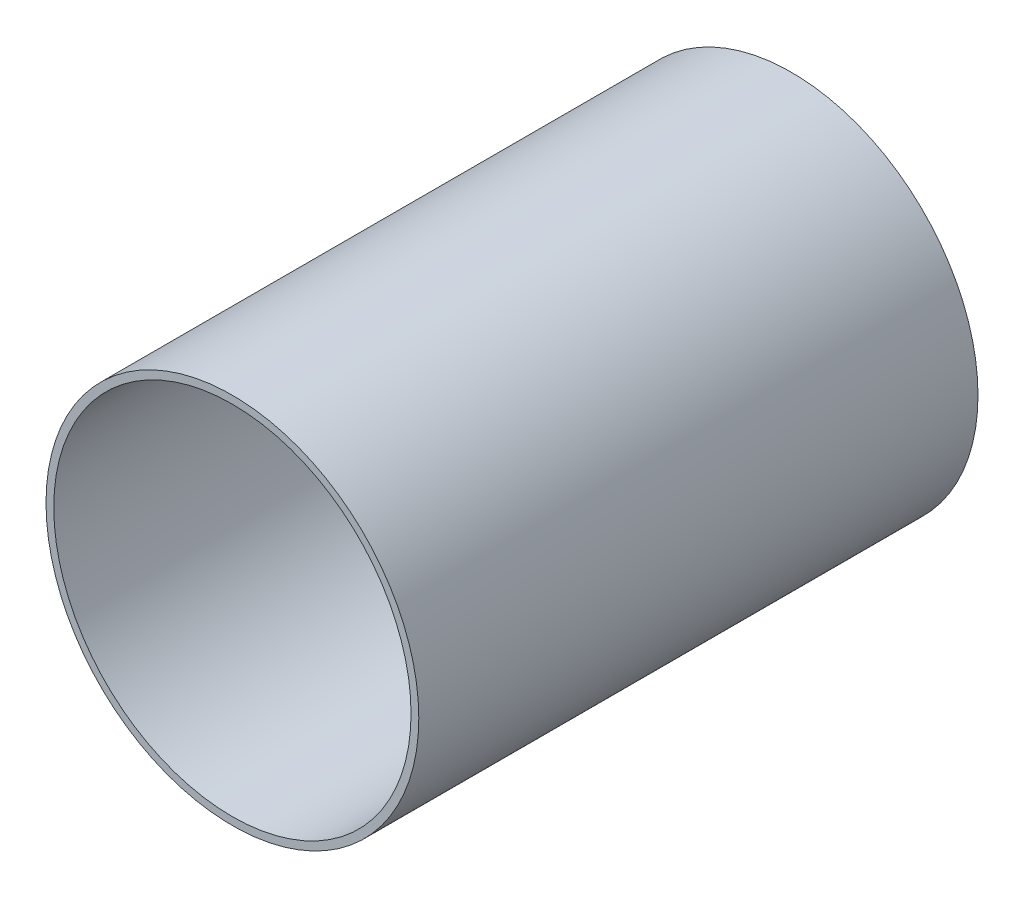
ISO-10303-21;
HEADER;
FILE_DESCRIPTION(('STEP AP214'),'2;1');
FILE_NAME('part.step','',(''),(''),'','','');
FILE_SCHEMA(('AUTOMOTIVE_DESIGN { 1 0 10303 214 1 1 1 1 }'));
ENDSEC;
DATA;
#1=APPLICATION_CONTEXT('core data for automotive mechanical design processes');
#2=APPLICATION_PROTOCOL_DEFINITION('international standard','automotive_design',2000,#1);
#3=PRODUCT_CONTEXT('',#1,'mechanical');
#4=PRODUCT('Part','Part','',(#3));
#5=PRODUCT_RELATED_PRODUCT_CATEGORY('part','',(#4));
#6=PRODUCT_DEFINITION_FORMATION('','',#4);
#7=PRODUCT_DEFINITION_CONTEXT('part definition',#1,'design');
#8=PRODUCT_DEFINITION('design','',#6,#7);
#9=PRODUCT_DEFINITION_SHAPE('','',#8);
#10=(LENGTH_UNIT() NAMED_UNIT(*) SI_UNIT(.MILLI.,.METRE.));
#11=(NAMED_UNIT(*) PLANE_ANGLE_UNIT() SI_UNIT($,.RADIAN.));
#12=(NAMED_UNIT(*) SI_UNIT($,.STERADIAN.) SOLID_ANGLE_UNIT());
#13=UNCERTAINTY_MEASURE_WITH_UNIT(LENGTH_MEASURE(1.E-05),#10,'distance_accuracy_value','');
#14=(GEOMETRIC_REPRESENTATION_CONTEXT(3) GLOBAL_UNCERTAINTY_ASSIGNED_CONTEXT((#13)) GLOBAL_UNIT_ASSIGNED_CONTEXT((#10,
#11,#12)) REPRESENTATION_CONTEXT('',''));
#15=CARTESIAN_POINT('',(0.,0.,0.));
#16=DIRECTION('',(0.,0.,1.));
#17=DIRECTION('',(1.,0.,0.));
#18=AXIS2_PLACEMENT_3D('',#15,#16,#17);
#19=CARTESIAN_POINT('',(0.,0.,228.6));
#20=DIRECTION('',(0.,0.,1.));
#21=DIRECTION('',(1.,0.,0.));
#22=AXIS2_PLACEMENT_3D('',#19,#20,#21);
#23=PLANE('',#22);
#24=CARTESIAN_POINT('',(0.,0.,228.6));
#25=DIRECTION('',(0.,0.,1.));
#26=DIRECTION('',(1.,0.,0.));
#27=AXIS2_PLACEMENT_3D('',#24,#25,#26);
#28=CIRCLE('',#27,76.2);
#29=CARTESIAN_POINT('',(76.2,0.,228.6));
#30=VERTEX_POINT('',#29);
#31=EDGE_CURVE('E10',#30,#30,#28,.T.);
#32=ORIENTED_EDGE('',*,*,#31,.T.);
#33=EDGE_LOOP('',(#32));
#34=FACE_BOUND('',#33,.T.);
#35=CARTESIAN_POINT('',(0.,0.,228.6));
#36=DIRECTION('',(0.,0.,1.));
#37=DIRECTION('',(1.,0.,0.));
#38=AXIS2_PLACEMENT_3D('',#35,#36,#37);
#39=CIRCLE('',#38,73.025);
#40=CARTESIAN_POINT('',(73.025,0.,228.6));
#41=VERTEX_POINT('',#40);
#42=EDGE_CURVE('E56',#41,#41,#39,.T.);
#43=ORIENTED_EDGE('',*,*,#42,.F.);
#44=EDGE_LOOP('',(#43));
#45=FACE_BOUND('',#44,.T.);
#46=ADVANCED_FACE('F43',(#34,#45),#23,.T.);
#47=CARTESIAN_POINT('',(0.,0.,0.));
#48=DIRECTION('',(0.,0.,1.));
#49=DIRECTION('',(1.,0.,0.));
#50=AXIS2_PLACEMENT_3D('',#47,#48,#49);
#51=PLANE('',#50);
#52=CARTESIAN_POINT('',(0.,0.,0.));
#53=DIRECTION('',(0.,0.,1.));
#54=DIRECTION('',(1.,0.,0.));
#55=AXIS2_PLACEMENT_3D('',#52,#53,#54);
#56=CIRCLE('',#55,76.2);
#57=CARTESIAN_POINT('',(76.2,0.,0.));
#58=VERTEX_POINT('',#57);
#59=EDGE_CURVE('E47',#58,#58,#56,.T.);
#60=ORIENTED_EDGE('',*,*,#59,.F.);
#61=EDGE_LOOP('',(#60));
#62=FACE_BOUND('',#61,.T.);
#63=CARTESIAN_POINT('',(0.,0.,0.));
#64=DIRECTION('',(0.,0.,1.));
#65=DIRECTION('',(1.,0.,0.));
#66=AXIS2_PLACEMENT_3D('',#63,#64,#65);
#67=CIRCLE('',#66,73.025);
#68=CARTESIAN_POINT('',(73.025,0.,0.));
#69=VERTEX_POINT('',#68);
#70=EDGE_CURVE('E58',#69,#69,#67,.T.);
#71=ORIENTED_EDGE('',*,*,#70,.T.);
#72=EDGE_LOOP('',(#71));
#73=FACE_BOUND('',#72,.T.);
#74=ADVANCED_FACE('F70',(#62,#73),#51,.F.);
#75=CARTESIAN_POINT('',(0.,0.,228.6));
#76=DIRECTION('',(0.,0.,-1.));
#77=DIRECTION('',(-1.,0.,0.));
#78=AXIS2_PLACEMENT_3D('',#75,#76,#77);
#79=CYLINDRICAL_SURFACE('',#78,76.2);
#80=ORIENTED_EDGE('',*,*,#31,.F.);
#81=EDGE_LOOP('',(#80));
#82=FACE_BOUND('',#81,.T.);
#83=ORIENTED_EDGE('',*,*,#59,.T.);
#84=EDGE_LOOP('',(#83));
#85=FACE_BOUND('',#84,.T.);
#86=ADVANCED_FACE('F45',(#82,#85),#79,.T.);
#87=CARTESIAN_POINT('',(0.,0.,228.6));
#88=DIRECTION('',(0.,0.,-1.));
#89=DIRECTION('',(-1.,0.,0.));
#90=AXIS2_PLACEMENT_3D('',#87,#88,#89);
#91=CYLINDRICAL_SURFACE('',#90,73.025);
#92=ORIENTED_EDGE('',*,*,#42,.T.);
#93=EDGE_LOOP('',(#92));
#94=FACE_BOUND('',#93,.T.);
#95=ORIENTED_EDGE('',*,*,#70,.F.);
#96=EDGE_LOOP('',(#95));
#97=FACE_BOUND('',#96,.T.);
#98=ADVANCED_FACE('F66',(#94,#97),#91,.F.);
#99=CLOSED_SHELL('',(#46,#74,#86,#98));
#100=MANIFOLD_SOLID_BREP('B2',#99);
#101=ADVANCED_BREP_SHAPE_REPRESENTATION('',(#18,#100),#14);
#102=SHAPE_DEFINITION_REPRESENTATION(#9,#101);
ENDSEC;
END-ISO-10303-21;
